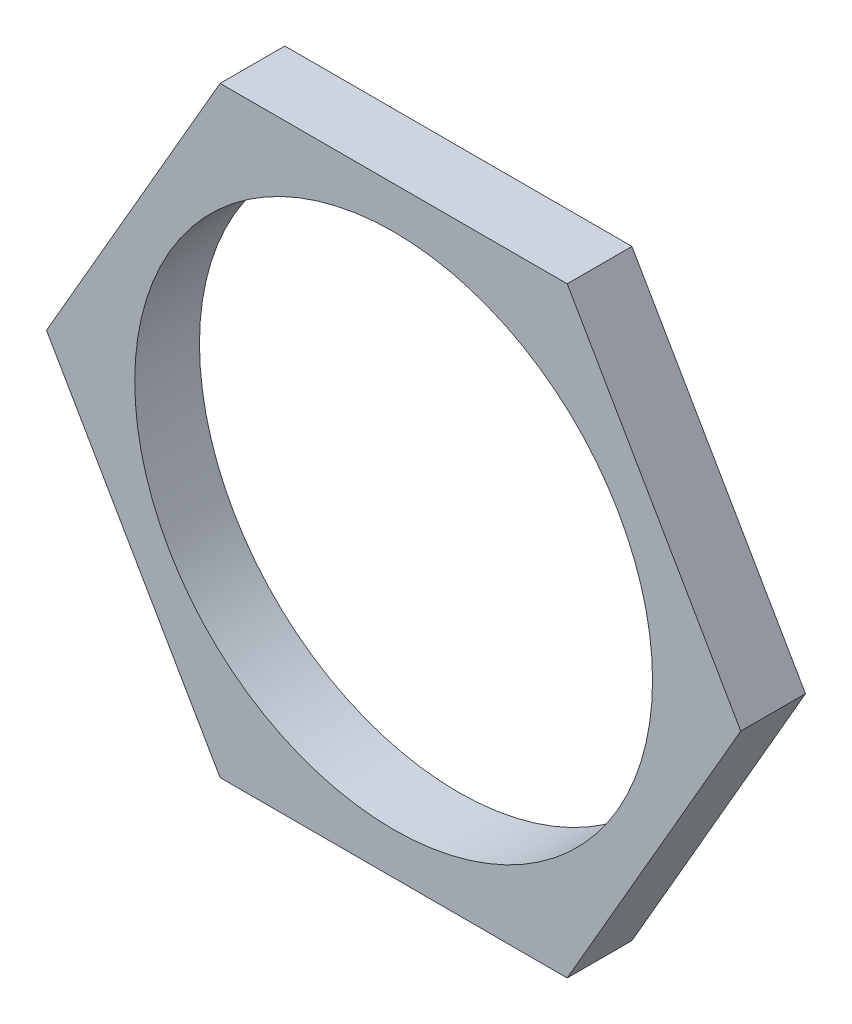
ISO-10303-21;
HEADER;
FILE_DESCRIPTION(('STEP AP214'),'2;1');
FILE_NAME('part.step','',(''),(''),'','','');
FILE_SCHEMA(('AUTOMOTIVE_DESIGN { 1 0 10303 214 1 1 1 1 }'));
ENDSEC;
DATA;
#1=APPLICATION_CONTEXT('core data for automotive mechanical design processes');
#2=APPLICATION_PROTOCOL_DEFINITION('international standard','automotive_design',2000,#1);
#3=PRODUCT_CONTEXT('',#1,'mechanical');
#4=PRODUCT('Part','Part','',(#3));
#5=PRODUCT_RELATED_PRODUCT_CATEGORY('part','',(#4));
#6=PRODUCT_DEFINITION_FORMATION('','',#4);
#7=PRODUCT_DEFINITION_CONTEXT('part definition',#1,'design');
#8=PRODUCT_DEFINITION('design','',#6,#7);
#9=PRODUCT_DEFINITION_SHAPE('','',#8);
#10=(LENGTH_UNIT() NAMED_UNIT(*) SI_UNIT(.MILLI.,.METRE.));
#11=(NAMED_UNIT(*) PLANE_ANGLE_UNIT() SI_UNIT($,.RADIAN.));
#12=(NAMED_UNIT(*) SI_UNIT($,.STERADIAN.) SOLID_ANGLE_UNIT());
#13=UNCERTAINTY_MEASURE_WITH_UNIT(LENGTH_MEASURE(1.E-05),#10,'distance_accuracy_value','');
#14=(GEOMETRIC_REPRESENTATION_CONTEXT(3) GLOBAL_UNCERTAINTY_ASSIGNED_CONTEXT((#13)) GLOBAL_UNIT_ASSIGNED_CONTEXT((#10,
#11,#12)) REPRESENTATION_CONTEXT('',''));
#15=CARTESIAN_POINT('',(0.,0.,0.));
#16=DIRECTION('',(0.,0.,1.));
#17=DIRECTION('',(1.,0.,0.));
#18=AXIS2_PLACEMENT_3D('',#15,#16,#17);
#19=CARTESIAN_POINT('',(0.,0.,1.5));
#20=DIRECTION('',(0.,0.,1.));
#21=DIRECTION('',(1.,0.,0.));
#22=AXIS2_PLACEMENT_3D('',#19,#20,#21);
#23=PLANE('',#22);
#24=DIRECTION('',(0.499999999999995,0.866025403784442,0.));
#25=VECTOR('',#24,1.);
#26=CARTESIAN_POINT('',(4.02207121876067,-6.96643170255377,1.5));
#27=LINE('',#26,#25);
#28=CARTESIAN_POINT('',(4.02207121876067,-6.96643170255377,1.5));
#29=VERTEX_POINT('',#28);
#30=CARTESIAN_POINT('',(8.04414243752118,0.,1.5));
#31=VERTEX_POINT('',#30);
#32=EDGE_CURVE('E133',#29,#31,#27,.T.);
#33=ORIENTED_EDGE('',*,*,#32,.T.);
#34=DIRECTION('',(-0.500000000000001,0.866025403784438,0.));
#35=VECTOR('',#34,1.);
#36=CARTESIAN_POINT('',(8.04414243752118,0.,1.5));
#37=LINE('',#36,#35);
#38=CARTESIAN_POINT('',(4.02207121876058,6.96643170255383,1.5));
#39=VERTEX_POINT('',#38);
#40=EDGE_CURVE('E91',#31,#39,#37,.T.);
#41=ORIENTED_EDGE('',*,*,#40,.T.);
#42=DIRECTION('',(-1.,0.,0.));
#43=VECTOR('',#42,1.);
#44=CARTESIAN_POINT('',(4.02207121876058,6.96643170255383,1.5));
#45=LINE('',#44,#43);
#46=CARTESIAN_POINT('',(-4.02207121876062,6.9664317025538,1.5));
#47=VERTEX_POINT('',#46);
#48=EDGE_CURVE('E104',#39,#47,#45,.T.);
#49=ORIENTED_EDGE('',*,*,#48,.T.);
#50=DIRECTION('',(-0.499999999999995,-0.866025403784442,0.));
#51=VECTOR('',#50,1.);
#52=CARTESIAN_POINT('',(-4.02207121876062,6.9664317025538,1.5));
#53=LINE('',#52,#51);
#54=CARTESIAN_POINT('',(-8.04414243752118,0.,1.5));
#55=VERTEX_POINT('',#54);
#56=EDGE_CURVE('E98',#47,#55,#53,.T.);
#57=ORIENTED_EDGE('',*,*,#56,.T.);
#58=DIRECTION('',(0.500000000000007,-0.866025403784434,0.));
#59=VECTOR('',#58,1.);
#60=CARTESIAN_POINT('',(-8.04414243752118,0.,1.5));
#61=LINE('',#60,#59);
#62=CARTESIAN_POINT('',(-4.02207121876053,-6.96643170255386,1.5));
#63=VERTEX_POINT('',#62);
#64=EDGE_CURVE('E102',#55,#63,#61,.T.);
#65=ORIENTED_EDGE('',*,*,#64,.T.);
#66=DIRECTION('',(1.,0.,0.));
#67=VECTOR('',#66,1.);
#68=CARTESIAN_POINT('',(-4.02207121876053,-6.96643170255386,1.5));
#69=LINE('',#68,#67);
#70=EDGE_CURVE('E54',#63,#29,#69,.T.);
#71=ORIENTED_EDGE('',*,*,#70,.T.);
#72=EDGE_LOOP('',(#33,#41,#49,#57,#65,#71));
#73=FACE_BOUND('',#72,.T.);
#74=CARTESIAN_POINT('',(0.,0.,1.5));
#75=DIRECTION('',(0.,0.,1.));
#76=DIRECTION('',(1.,0.,0.));
#77=AXIS2_PLACEMENT_3D('',#74,#75,#76);
#78=CIRCLE('',#77,6.);
#79=CARTESIAN_POINT('',(6.,0.,1.5));
#80=VERTEX_POINT('',#79);
#81=EDGE_CURVE('E126',#80,#80,#78,.T.);
#82=ORIENTED_EDGE('',*,*,#81,.F.);
#83=EDGE_LOOP('',(#82));
#84=FACE_BOUND('',#83,.T.);
#85=ADVANCED_FACE('F37',(#73,#84),#23,.T.);
#86=CARTESIAN_POINT('',(0.,0.,0.));
#87=DIRECTION('',(0.,0.,1.));
#88=DIRECTION('',(1.,0.,0.));
#89=AXIS2_PLACEMENT_3D('',#86,#87,#88);
#90=PLANE('',#89);
#91=DIRECTION('',(0.499999999999995,0.866025403784442,0.));
#92=VECTOR('',#91,1.);
#93=CARTESIAN_POINT('',(4.02207121876067,-6.96643170255377,0.));
#94=LINE('',#93,#92);
#95=CARTESIAN_POINT('',(4.02207121876067,-6.96643170255377,0.));
#96=VERTEX_POINT('',#95);
#97=CARTESIAN_POINT('',(8.04414243752118,0.,0.));
#98=VERTEX_POINT('',#97);
#99=EDGE_CURVE('E122',#96,#98,#94,.T.);
#100=ORIENTED_EDGE('',*,*,#99,.F.);
#101=DIRECTION('',(1.,0.,0.));
#102=VECTOR('',#101,1.);
#103=CARTESIAN_POINT('',(-4.02207121876053,-6.96643170255386,0.));
#104=LINE('',#103,#102);
#105=CARTESIAN_POINT('',(-4.02207121876053,-6.96643170255386,0.));
#106=VERTEX_POINT('',#105);
#107=EDGE_CURVE('E83',#106,#96,#104,.T.);
#108=ORIENTED_EDGE('',*,*,#107,.F.);
#109=DIRECTION('',(0.500000000000007,-0.866025403784434,0.));
#110=VECTOR('',#109,1.);
#111=CARTESIAN_POINT('',(-8.04414243752118,0.,0.));
#112=LINE('',#111,#110);
#113=CARTESIAN_POINT('',(-8.04414243752118,0.,0.));
#114=VERTEX_POINT('',#113);
#115=EDGE_CURVE('E77',#114,#106,#112,.T.);
#116=ORIENTED_EDGE('',*,*,#115,.F.);
#117=DIRECTION('',(-0.499999999999995,-0.866025403784442,0.));
#118=VECTOR('',#117,1.);
#119=CARTESIAN_POINT('',(-4.02207121876062,6.9664317025538,0.));
#120=LINE('',#119,#118);
#121=CARTESIAN_POINT('',(-4.02207121876062,6.9664317025538,0.));
#122=VERTEX_POINT('',#121);
#123=EDGE_CURVE('E112',#122,#114,#120,.T.);
#124=ORIENTED_EDGE('',*,*,#123,.F.);
#125=DIRECTION('',(-1.,0.,0.));
#126=VECTOR('',#125,1.);
#127=CARTESIAN_POINT('',(4.02207121876058,6.96643170255383,0.));
#128=LINE('',#127,#126);
#129=CARTESIAN_POINT('',(4.02207121876058,6.96643170255383,0.));
#130=VERTEX_POINT('',#129);
#131=EDGE_CURVE('E128',#130,#122,#128,.T.);
#132=ORIENTED_EDGE('',*,*,#131,.F.);
#133=DIRECTION('',(-0.500000000000001,0.866025403784438,0.));
#134=VECTOR('',#133,1.);
#135=CARTESIAN_POINT('',(8.04414243752118,0.,0.));
#136=LINE('',#135,#134);
#137=EDGE_CURVE('E125',#98,#130,#136,.T.);
#138=ORIENTED_EDGE('',*,*,#137,.F.);
#139=EDGE_LOOP('',(#100,#108,#116,#124,#132,#138));
#140=FACE_BOUND('',#139,.T.);
#141=CARTESIAN_POINT('',(0.,0.,0.));
#142=DIRECTION('',(0.,0.,1.));
#143=DIRECTION('',(1.,0.,0.));
#144=AXIS2_PLACEMENT_3D('',#141,#142,#143);
#145=CIRCLE('',#144,6.);
#146=CARTESIAN_POINT('',(6.,0.,0.));
#147=VERTEX_POINT('',#146);
#148=EDGE_CURVE('E226',#147,#147,#145,.T.);
#149=ORIENTED_EDGE('',*,*,#148,.T.);
#150=EDGE_LOOP('',(#149));
#151=FACE_BOUND('',#150,.T.);
#152=ADVANCED_FACE('F142',(#140,#151),#90,.F.);
#153=CARTESIAN_POINT('',(4.02207121876067,-6.96643170255377,1.5));
#154=DIRECTION('',(-0.866025403784441,0.499999999999995,0.));
#155=DIRECTION('',(-0.499999999999995,-0.866025403784442,0.));
#156=AXIS2_PLACEMENT_3D('',#153,#154,#155);
#157=PLANE('',#156);
#158=ORIENTED_EDGE('',*,*,#99,.T.);
#159=DIRECTION('',(0.,0.,-1.));
#160=VECTOR('',#159,1.);
#161=CARTESIAN_POINT('',(8.04414243752118,0.,1.5));
#162=LINE('',#161,#160);
#163=EDGE_CURVE('E11',#31,#98,#162,.T.);
#164=ORIENTED_EDGE('',*,*,#163,.F.);
#165=ORIENTED_EDGE('',*,*,#32,.F.);
#166=DIRECTION('',(0.,0.,-1.));
#167=VECTOR('',#166,1.);
#168=CARTESIAN_POINT('',(4.02207121876067,-6.96643170255377,1.5));
#169=LINE('',#168,#167);
#170=EDGE_CURVE('E118',#29,#96,#169,.T.);
#171=ORIENTED_EDGE('',*,*,#170,.T.);
#172=EDGE_LOOP('',(#158,#164,#165,#171));
#173=FACE_BOUND('',#172,.T.);
#174=ADVANCED_FACE('F39',(#173),#157,.F.);
#175=CARTESIAN_POINT('',(8.04414243752118,0.,1.5));
#176=DIRECTION('',(-0.866025403784438,-0.500000000000001,0.));
#177=DIRECTION('',(0.500000000000001,-0.866025403784438,0.));
#178=AXIS2_PLACEMENT_3D('',#175,#176,#177);
#179=PLANE('',#178);
#180=ORIENTED_EDGE('',*,*,#137,.T.);
#181=DIRECTION('',(0.,0.,-1.));
#182=VECTOR('',#181,1.);
#183=CARTESIAN_POINT('',(4.02207121876058,6.96643170255383,1.5));
#184=LINE('',#183,#182);
#185=EDGE_CURVE('E46',#39,#130,#184,.T.);
#186=ORIENTED_EDGE('',*,*,#185,.F.);
#187=ORIENTED_EDGE('',*,*,#40,.F.);
#188=ORIENTED_EDGE('',*,*,#163,.T.);
#189=EDGE_LOOP('',(#180,#186,#187,#188));
#190=FACE_BOUND('',#189,.T.);
#191=ADVANCED_FACE('F167',(#190),#179,.F.);
#192=CARTESIAN_POINT('',(4.02207121876058,6.96643170255383,1.5));
#193=DIRECTION('',(0.,-1.,0.));
#194=DIRECTION('',(1.,0.,0.));
#195=AXIS2_PLACEMENT_3D('',#192,#193,#194);
#196=PLANE('',#195);
#197=ORIENTED_EDGE('',*,*,#131,.T.);
#198=DIRECTION('',(0.,0.,-1.));
#199=VECTOR('',#198,1.);
#200=CARTESIAN_POINT('',(-4.02207121876062,6.9664317025538,1.5));
#201=LINE('',#200,#199);
#202=EDGE_CURVE('E113',#47,#122,#201,.T.);
#203=ORIENTED_EDGE('',*,*,#202,.F.);
#204=ORIENTED_EDGE('',*,*,#48,.F.);
#205=ORIENTED_EDGE('',*,*,#185,.T.);
#206=EDGE_LOOP('',(#197,#203,#204,#205));
#207=FACE_BOUND('',#206,.T.);
#208=ADVANCED_FACE('F139',(#207),#196,.F.);
#209=CARTESIAN_POINT('',(-4.02207121876062,6.9664317025538,1.5));
#210=DIRECTION('',(0.866025403784442,-0.499999999999995,0.));
#211=DIRECTION('',(0.499999999999995,0.866025403784442,0.));
#212=AXIS2_PLACEMENT_3D('',#209,#210,#211);
#213=PLANE('',#212);
#214=ORIENTED_EDGE('',*,*,#123,.T.);
#215=DIRECTION('',(0.,0.,-1.));
#216=VECTOR('',#215,1.);
#217=CARTESIAN_POINT('',(-8.04414243752118,0.,1.5));
#218=LINE('',#217,#216);
#219=EDGE_CURVE('E109',#55,#114,#218,.T.);
#220=ORIENTED_EDGE('',*,*,#219,.F.);
#221=ORIENTED_EDGE('',*,*,#56,.F.);
#222=ORIENTED_EDGE('',*,*,#202,.T.);
#223=EDGE_LOOP('',(#214,#220,#221,#222));
#224=FACE_BOUND('',#223,.T.);
#225=ADVANCED_FACE('F110',(#224),#213,.F.);
#226=CARTESIAN_POINT('',(-8.04414243752118,0.,1.5));
#227=DIRECTION('',(0.866025403784435,0.500000000000007,0.));
#228=DIRECTION('',(-0.500000000000007,0.866025403784435,0.));
#229=AXIS2_PLACEMENT_3D('',#226,#227,#228);
#230=PLANE('',#229);
#231=ORIENTED_EDGE('',*,*,#115,.T.);
#232=DIRECTION('',(0.,0.,-1.));
#233=VECTOR('',#232,1.);
#234=CARTESIAN_POINT('',(-4.02207121876053,-6.96643170255386,1.5));
#235=LINE('',#234,#233);
#236=EDGE_CURVE('E114',#63,#106,#235,.T.);
#237=ORIENTED_EDGE('',*,*,#236,.F.);
#238=ORIENTED_EDGE('',*,*,#64,.F.);
#239=ORIENTED_EDGE('',*,*,#219,.T.);
#240=EDGE_LOOP('',(#231,#237,#238,#239));
#241=FACE_BOUND('',#240,.T.);
#242=ADVANCED_FACE('F116',(#241),#230,.F.);
#243=CARTESIAN_POINT('',(-4.02207121876053,-6.96643170255386,1.5));
#244=DIRECTION('',(0.,1.,0.));
#245=DIRECTION('',(-1.,0.,0.));
#246=AXIS2_PLACEMENT_3D('',#243,#244,#245);
#247=PLANE('',#246);
#248=ORIENTED_EDGE('',*,*,#107,.T.);
#249=ORIENTED_EDGE('',*,*,#170,.F.);
#250=ORIENTED_EDGE('',*,*,#70,.F.);
#251=ORIENTED_EDGE('',*,*,#236,.T.);
#252=EDGE_LOOP('',(#248,#249,#250,#251));
#253=FACE_BOUND('',#252,.T.);
#254=ADVANCED_FACE('F147',(#253),#247,.F.);
#255=CARTESIAN_POINT('',(0.,0.,1.5));
#256=DIRECTION('',(0.,0.,-1.));
#257=DIRECTION('',(-1.,0.,0.));
#258=AXIS2_PLACEMENT_3D('',#255,#256,#257);
#259=CYLINDRICAL_SURFACE('',#258,6.);
#260=ORIENTED_EDGE('',*,*,#81,.T.);
#261=EDGE_LOOP('',(#260));
#262=FACE_BOUND('',#261,.T.);
#263=ORIENTED_EDGE('',*,*,#148,.F.);
#264=EDGE_LOOP('',(#263));
#265=FACE_BOUND('',#264,.T.);
#266=ADVANCED_FACE('F149',(#262,#265),#259,.F.);
#267=CLOSED_SHELL('',(#85,#152,#174,#191,#208,#225,#242,#254,#266));
#268=MANIFOLD_SOLID_BREP('B2',#267);
#269=ADVANCED_BREP_SHAPE_REPRESENTATION('',(#18,#268),#14);
#270=SHAPE_DEFINITION_REPRESENTATION(#9,#269);
ENDSEC;
END-ISO-10303-21;
